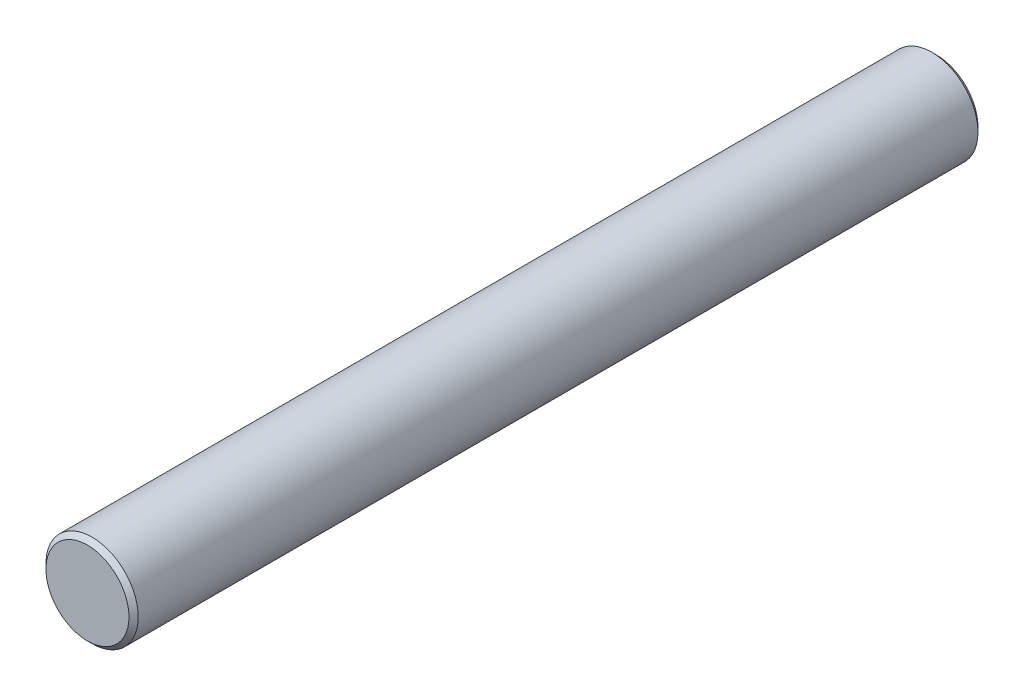
ISO-10303-21;
HEADER;
FILE_DESCRIPTION(('STEP AP214'),'2;1');
FILE_NAME('part.step','',(''),(''),'','','');
FILE_SCHEMA(('AUTOMOTIVE_DESIGN { 1 0 10303 214 1 1 1 1 }'));
ENDSEC;
DATA;
#1=APPLICATION_CONTEXT('core data for automotive mechanical design processes');
#2=APPLICATION_PROTOCOL_DEFINITION('international standard','automotive_design',2000,#1);
#3=PRODUCT_CONTEXT('',#1,'mechanical');
#4=PRODUCT('Part','Part','',(#3));
#5=PRODUCT_RELATED_PRODUCT_CATEGORY('part','',(#4));
#6=PRODUCT_DEFINITION_FORMATION('','',#4);
#7=PRODUCT_DEFINITION_CONTEXT('part definition',#1,'design');
#8=PRODUCT_DEFINITION('design','',#6,#7);
#9=PRODUCT_DEFINITION_SHAPE('','',#8);
#10=(LENGTH_UNIT() NAMED_UNIT(*) SI_UNIT(.MILLI.,.METRE.));
#11=(NAMED_UNIT(*) PLANE_ANGLE_UNIT() SI_UNIT($,.RADIAN.));
#12=(NAMED_UNIT(*) SI_UNIT($,.STERADIAN.) SOLID_ANGLE_UNIT());
#13=UNCERTAINTY_MEASURE_WITH_UNIT(LENGTH_MEASURE(1.E-05),#10,'distance_accuracy_value','');
#14=(GEOMETRIC_REPRESENTATION_CONTEXT(3) GLOBAL_UNCERTAINTY_ASSIGNED_CONTEXT((#13)) GLOBAL_UNIT_ASSIGNED_CONTEXT((#10,
#11,#12)) REPRESENTATION_CONTEXT('',''));
#15=CARTESIAN_POINT('',(0.,0.,0.));
#16=DIRECTION('',(0.,0.,1.));
#17=DIRECTION('',(1.,0.,0.));
#18=AXIS2_PLACEMENT_3D('',#15,#16,#17);
#19=CARTESIAN_POINT('',(0.,0.,46.));
#20=DIRECTION('',(0.,0.,-1.));
#21=DIRECTION('',(-1.,0.,0.));
#22=AXIS2_PLACEMENT_3D('',#19,#20,#21);
#23=CYLINDRICAL_SURFACE('',#22,2.5);
#24=CARTESIAN_POINT('',(0.,0.,45.75));
#25=DIRECTION('',(0.,0.,1.));
#26=DIRECTION('',(1.,0.,0.));
#27=AXIS2_PLACEMENT_3D('',#24,#25,#26);
#28=CIRCLE('',#27,2.5);
#29=CARTESIAN_POINT('',(2.5,0.,45.75));
#30=VERTEX_POINT('',#29);
#31=EDGE_CURVE('E41',#30,#30,#28,.F.);
#32=ORIENTED_EDGE('',*,*,#31,.T.);
#33=EDGE_LOOP('',(#32));
#34=FACE_BOUND('',#33,.T.);
#35=CARTESIAN_POINT('',(0.,0.,0.250000000000007));
#36=DIRECTION('',(0.,0.,1.));
#37=DIRECTION('',(1.,0.,0.));
#38=AXIS2_PLACEMENT_3D('',#35,#36,#37);
#39=CIRCLE('',#38,2.5);
#40=CARTESIAN_POINT('',(2.5,0.,0.250000000000007));
#41=VERTEX_POINT('',#40);
#42=EDGE_CURVE('E45',#41,#41,#39,.T.);
#43=ORIENTED_EDGE('',*,*,#42,.T.);
#44=EDGE_LOOP('',(#43));
#45=FACE_BOUND('',#44,.T.);
#46=ADVANCED_FACE('F33',(#34,#45),#23,.T.);
#47=CARTESIAN_POINT('',(0.,0.,46.));
#48=DIRECTION('',(0.,0.,1.));
#49=DIRECTION('',(1.,0.,0.));
#50=AXIS2_PLACEMENT_3D('',#47,#48,#49);
#51=PLANE('',#50);
#52=CARTESIAN_POINT('',(0.,0.,46.));
#53=DIRECTION('',(0.,0.,1.));
#54=DIRECTION('',(1.,0.,0.));
#55=AXIS2_PLACEMENT_3D('',#52,#53,#54);
#56=CIRCLE('',#55,2.24999999999999);
#57=CARTESIAN_POINT('',(2.24999999999999,0.,46.));
#58=VERTEX_POINT('',#57);
#59=EDGE_CURVE('E49',#58,#58,#56,.T.);
#60=ORIENTED_EDGE('',*,*,#59,.T.);
#61=EDGE_LOOP('',(#60));
#62=FACE_BOUND('',#61,.T.);
#63=ADVANCED_FACE('F55',(#62),#51,.T.);
#64=CARTESIAN_POINT('',(0.,0.,0.));
#65=DIRECTION('',(0.,0.,1.));
#66=DIRECTION('',(1.,0.,0.));
#67=AXIS2_PLACEMENT_3D('',#64,#65,#66);
#68=PLANE('',#67);
#69=CARTESIAN_POINT('',(0.,0.,0.));
#70=DIRECTION('',(0.,0.,1.));
#71=DIRECTION('',(1.,0.,0.));
#72=AXIS2_PLACEMENT_3D('',#69,#70,#71);
#73=CIRCLE('',#72,2.25);
#74=CARTESIAN_POINT('',(2.25,0.,0.));
#75=VERTEX_POINT('',#74);
#76=EDGE_CURVE('E10',#75,#75,#73,.F.);
#77=ORIENTED_EDGE('',*,*,#76,.T.);
#78=EDGE_LOOP('',(#77));
#79=FACE_BOUND('',#78,.T.);
#80=ADVANCED_FACE('F59',(#79),#68,.F.);
#81=CARTESIAN_POINT('',(0.,0.,46.));
#82=DIRECTION('',(0.,0.,-1.));
#83=DIRECTION('',(-1.,0.,0.));
#84=AXIS2_PLACEMENT_3D('',#81,#82,#83);
#85=CONICAL_SURFACE('',#84,2.24999999999999,0.785398163397443);
#86=ORIENTED_EDGE('',*,*,#31,.F.);
#87=EDGE_LOOP('',(#86));
#88=FACE_BOUND('',#87,.T.);
#89=ORIENTED_EDGE('',*,*,#59,.F.);
#90=EDGE_LOOP('',(#89));
#91=FACE_BOUND('',#90,.T.);
#92=ADVANCED_FACE('F57',(#88,#91),#85,.T.);
#93=CARTESIAN_POINT('',(0.,0.,0.250000000000007));
#94=DIRECTION('',(0.,0.,1.));
#95=DIRECTION('',(1.,0.,0.));
#96=AXIS2_PLACEMENT_3D('',#93,#94,#95);
#97=CONICAL_SURFACE('',#96,2.5,0.785398163397443);
#98=ORIENTED_EDGE('',*,*,#76,.F.);
#99=EDGE_LOOP('',(#98));
#100=FACE_BOUND('',#99,.T.);
#101=ORIENTED_EDGE('',*,*,#42,.F.);
#102=EDGE_LOOP('',(#101));
#103=FACE_BOUND('',#102,.T.);
#104=ADVANCED_FACE('F36',(#100,#103),#97,.T.);
#105=CLOSED_SHELL('',(#46,#63,#80,#92,#104));
#106=MANIFOLD_SOLID_BREP('B2',#105);
#107=ADVANCED_BREP_SHAPE_REPRESENTATION('',(#18,#106),#14);
#108=SHAPE_DEFINITION_REPRESENTATION(#9,#107);
ENDSEC;
END-ISO-10303-21;
